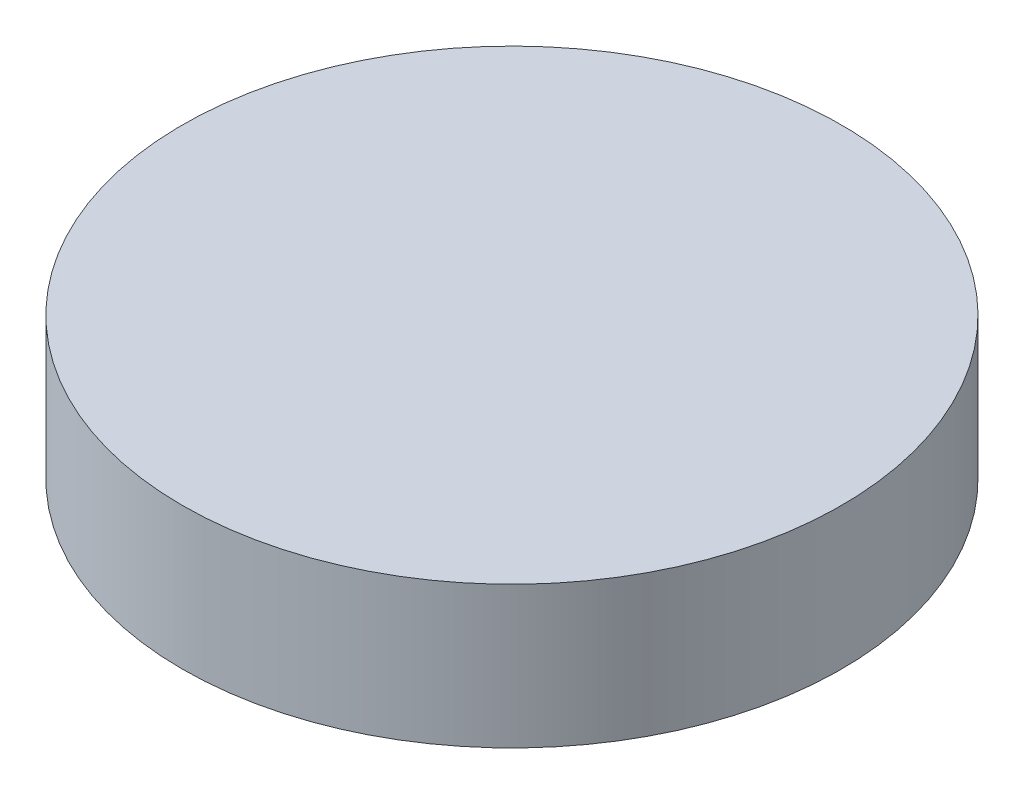
ISO-10303-21;
HEADER;
FILE_DESCRIPTION(('STEP AP214'),'2;1');
FILE_NAME('part.step','',(''),(''),'','','');
FILE_SCHEMA(('AUTOMOTIVE_DESIGN { 1 0 10303 214 1 1 1 1 }'));
ENDSEC;
DATA;
#1=APPLICATION_CONTEXT('core data for automotive mechanical design processes');
#2=APPLICATION_PROTOCOL_DEFINITION('international standard','automotive_design',2000,#1);
#3=PRODUCT_CONTEXT('',#1,'mechanical');
#4=PRODUCT('Part','Part','',(#3));
#5=PRODUCT_RELATED_PRODUCT_CATEGORY('part','',(#4));
#6=PRODUCT_DEFINITION_FORMATION('','',#4);
#7=PRODUCT_DEFINITION_CONTEXT('part definition',#1,'design');
#8=PRODUCT_DEFINITION('design','',#6,#7);
#9=PRODUCT_DEFINITION_SHAPE('','',#8);
#10=(LENGTH_UNIT() NAMED_UNIT(*) SI_UNIT(.MILLI.,.METRE.));
#11=(NAMED_UNIT(*) PLANE_ANGLE_UNIT() SI_UNIT($,.RADIAN.));
#12=(NAMED_UNIT(*) SI_UNIT($,.STERADIAN.) SOLID_ANGLE_UNIT());
#13=UNCERTAINTY_MEASURE_WITH_UNIT(LENGTH_MEASURE(1.E-05),#10,'distance_accuracy_value','');
#14=(GEOMETRIC_REPRESENTATION_CONTEXT(3) GLOBAL_UNCERTAINTY_ASSIGNED_CONTEXT((#13)) GLOBAL_UNIT_ASSIGNED_CONTEXT((#10,
#11,#12)) REPRESENTATION_CONTEXT('',''));
#15=CARTESIAN_POINT('',(0.,0.,0.));
#16=DIRECTION('',(0.,0.,1.));
#17=DIRECTION('',(1.,0.,0.));
#18=AXIS2_PLACEMENT_3D('',#15,#16,#17);
#19=CARTESIAN_POINT('',(0.,0.,0.));
#20=DIRECTION('',(0.,1.,0.));
#21=DIRECTION('',(0.,0.,1.));
#22=AXIS2_PLACEMENT_3D('',#19,#20,#21);
#23=PLANE('',#22);
#24=CARTESIAN_POINT('',(0.,0.,0.));
#25=DIRECTION('',(0.,1.,0.));
#26=DIRECTION('',(0.,0.,1.));
#27=AXIS2_PLACEMENT_3D('',#24,#25,#26);
#28=CIRCLE('',#27,21.5);
#29=CARTESIAN_POINT('',(0.,0.,21.5));
#30=VERTEX_POINT('',#29);
#31=EDGE_CURVE('E10',#30,#30,#28,.T.);
#32=ORIENTED_EDGE('',*,*,#31,.F.);
#33=EDGE_LOOP('',(#32));
#34=FACE_BOUND('',#33,.T.);
#35=CARTESIAN_POINT('',(0.,0.,0.));
#36=DIRECTION('',(0.,1.,0.));
#37=DIRECTION('',(0.,0.,1.));
#38=AXIS2_PLACEMENT_3D('',#35,#36,#37);
#39=CIRCLE('',#38,20.);
#40=CARTESIAN_POINT('',(0.,0.,20.));
#41=VERTEX_POINT('',#40);
#42=EDGE_CURVE('E38',#41,#41,#39,.T.);
#43=ORIENTED_EDGE('',*,*,#42,.T.);
#44=EDGE_LOOP('',(#43));
#45=FACE_BOUND('',#44,.T.);
#46=ADVANCED_FACE('F31',(#34,#45),#23,.F.);
#47=CARTESIAN_POINT('',(0.,7.5,0.));
#48=DIRECTION('',(0.,-1.,0.));
#49=DIRECTION('',(0.,0.,-1.));
#50=AXIS2_PLACEMENT_3D('',#47,#48,#49);
#51=CYLINDRICAL_SURFACE('',#50,21.5);
#52=ORIENTED_EDGE('',*,*,#31,.T.);
#53=EDGE_LOOP('',(#52));
#54=FACE_BOUND('',#53,.T.);
#55=CARTESIAN_POINT('',(0.,9.25,0.));
#56=DIRECTION('',(0.,1.,0.));
#57=DIRECTION('',(0.,0.,1.));
#58=AXIS2_PLACEMENT_3D('',#55,#56,#57);
#59=CIRCLE('',#58,21.5);
#60=CARTESIAN_POINT('',(0.,9.25,21.5));
#61=VERTEX_POINT('',#60);
#62=EDGE_CURVE('E46',#61,#61,#59,.T.);
#63=ORIENTED_EDGE('',*,*,#62,.F.);
#64=EDGE_LOOP('',(#63));
#65=FACE_BOUND('',#64,.T.);
#66=ADVANCED_FACE('F33',(#54,#65),#51,.T.);
#67=CARTESIAN_POINT('',(0.,7.5,0.));
#68=DIRECTION('',(0.,-1.,0.));
#69=DIRECTION('',(0.,0.,-1.));
#70=AXIS2_PLACEMENT_3D('',#67,#68,#69);
#71=CYLINDRICAL_SURFACE('',#70,20.);
#72=CARTESIAN_POINT('',(0.,7.5,0.));
#73=DIRECTION('',(0.,1.,0.));
#74=DIRECTION('',(0.,0.,1.));
#75=AXIS2_PLACEMENT_3D('',#72,#73,#74);
#76=CIRCLE('',#75,20.);
#77=CARTESIAN_POINT('',(0.,7.5,20.));
#78=VERTEX_POINT('',#77);
#79=EDGE_CURVE('E42',#78,#78,#76,.T.);
#80=ORIENTED_EDGE('',*,*,#79,.T.);
#81=EDGE_LOOP('',(#80));
#82=FACE_BOUND('',#81,.T.);
#83=ORIENTED_EDGE('',*,*,#42,.F.);
#84=EDGE_LOOP('',(#83));
#85=FACE_BOUND('',#84,.T.);
#86=ADVANCED_FACE('F55',(#82,#85),#71,.F.);
#87=CARTESIAN_POINT('',(0.,7.5,0.));
#88=DIRECTION('',(0.,1.,0.));
#89=DIRECTION('',(0.,0.,1.));
#90=AXIS2_PLACEMENT_3D('',#87,#88,#89);
#91=PLANE('',#90);
#92=ORIENTED_EDGE('',*,*,#79,.F.);
#93=EDGE_LOOP('',(#92));
#94=FACE_BOUND('',#93,.T.);
#95=ADVANCED_FACE('F60',(#94),#91,.F.);
#96=CARTESIAN_POINT('',(0.,9.25,0.));
#97=DIRECTION('',(0.,1.,0.));
#98=DIRECTION('',(0.,0.,1.));
#99=AXIS2_PLACEMENT_3D('',#96,#97,#98);
#100=PLANE('',#99);
#101=ORIENTED_EDGE('',*,*,#62,.T.);
#102=EDGE_LOOP('',(#101));
#103=FACE_BOUND('',#102,.T.);
#104=ADVANCED_FACE('F52',(#103),#100,.T.);
#105=CLOSED_SHELL('',(#46,#66,#86,#95,#104));
#106=MANIFOLD_SOLID_BREP('B2',#105);
#107=ADVANCED_BREP_SHAPE_REPRESENTATION('',(#18,#106),#14);
#108=SHAPE_DEFINITION_REPRESENTATION(#9,#107);
ENDSEC;
END-ISO-10303-21;
